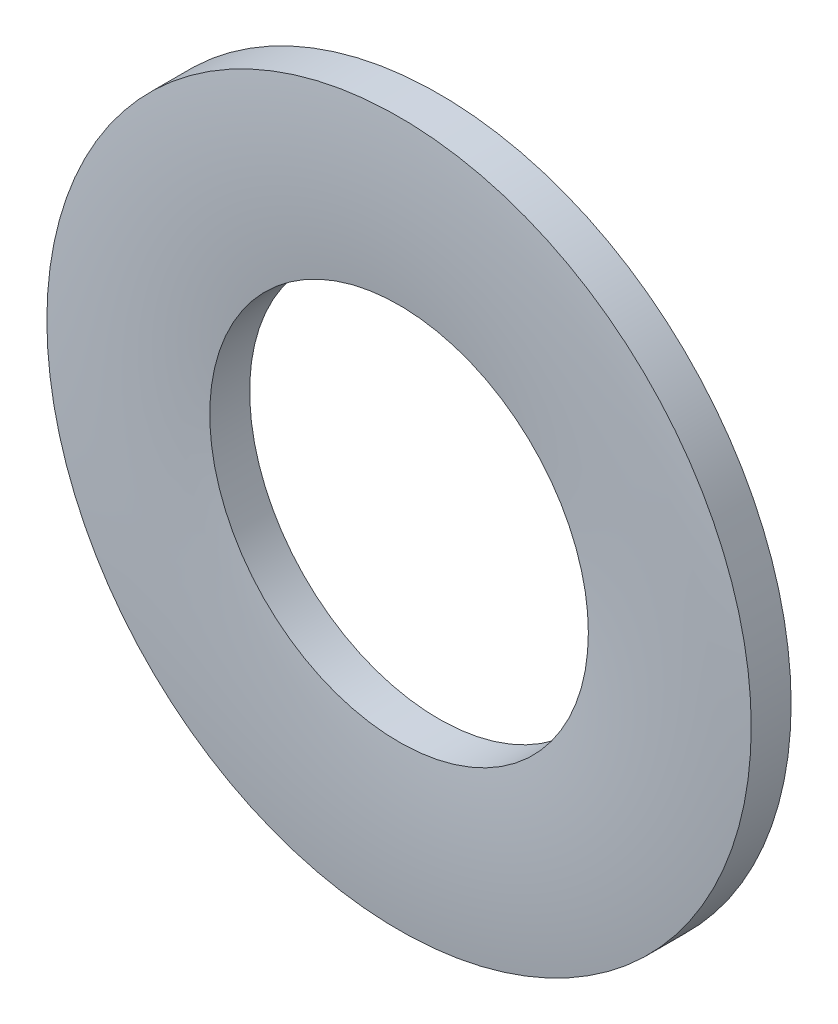
ISO-10303-21;
HEADER;
FILE_DESCRIPTION(('STEP AP214'),'2;1');
FILE_NAME('part.step','',(''),(''),'','','');
FILE_SCHEMA(('AUTOMOTIVE_DESIGN { 1 0 10303 214 1 1 1 1 }'));
ENDSEC;
DATA;
#1=APPLICATION_CONTEXT('core data for automotive mechanical design processes');
#2=APPLICATION_PROTOCOL_DEFINITION('international standard','automotive_design',2000,#1);
#3=PRODUCT_CONTEXT('',#1,'mechanical');
#4=PRODUCT('Part','Part','',(#3));
#5=PRODUCT_RELATED_PRODUCT_CATEGORY('part','',(#4));
#6=PRODUCT_DEFINITION_FORMATION('','',#4);
#7=PRODUCT_DEFINITION_CONTEXT('part definition',#1,'design');
#8=PRODUCT_DEFINITION('design','',#6,#7);
#9=PRODUCT_DEFINITION_SHAPE('','',#8);
#10=(LENGTH_UNIT() NAMED_UNIT(*) SI_UNIT(.MILLI.,.METRE.));
#11=(NAMED_UNIT(*) PLANE_ANGLE_UNIT() SI_UNIT($,.RADIAN.));
#12=(NAMED_UNIT(*) SI_UNIT($,.STERADIAN.) SOLID_ANGLE_UNIT());
#13=UNCERTAINTY_MEASURE_WITH_UNIT(LENGTH_MEASURE(1.E-05),#10,'distance_accuracy_value','');
#14=(GEOMETRIC_REPRESENTATION_CONTEXT(3) GLOBAL_UNCERTAINTY_ASSIGNED_CONTEXT((#13)) GLOBAL_UNIT_ASSIGNED_CONTEXT((#10,
#11,#12)) REPRESENTATION_CONTEXT('',''));
#15=CARTESIAN_POINT('',(0.,0.,0.));
#16=DIRECTION('',(0.,0.,1.));
#17=DIRECTION('',(1.,0.,0.));
#18=AXIS2_PLACEMENT_3D('',#15,#16,#17);
#19=CARTESIAN_POINT('',(0.,2.15,-0.25));
#20=DIRECTION('',(0.,0.,1.));
#21=DIRECTION('',(1.,0.,0.));
#22=AXIS2_PLACEMENT_3D('',#19,#20,#21);
#23=PLANE('',#22);
#24=CARTESIAN_POINT('',(0.,0.,-0.25));
#25=DIRECTION('',(0.,0.,1.));
#26=DIRECTION('',(1.,0.,0.));
#27=AXIS2_PLACEMENT_3D('',#24,#25,#26);
#28=CIRCLE('',#27,4.);
#29=CARTESIAN_POINT('',(4.,0.,-0.25));
#30=VERTEX_POINT('',#29);
#31=EDGE_CURVE('E44',#30,#30,#28,.T.);
#32=ORIENTED_EDGE('',*,*,#31,.F.);
#33=EDGE_LOOP('',(#32));
#34=FACE_BOUND('',#33,.T.);
#35=CARTESIAN_POINT('',(0.,0.,-0.25));
#36=DIRECTION('',(0.,0.,1.));
#37=DIRECTION('',(1.,0.,0.));
#38=AXIS2_PLACEMENT_3D('',#35,#36,#37);
#39=CIRCLE('',#38,2.15);
#40=CARTESIAN_POINT('',(2.15,0.,-0.25));
#41=VERTEX_POINT('',#40);
#42=EDGE_CURVE('E10',#41,#41,#39,.T.);
#43=ORIENTED_EDGE('',*,*,#42,.T.);
#44=EDGE_LOOP('',(#43));
#45=FACE_BOUND('',#44,.T.);
#46=ADVANCED_FACE('F30',(#34,#45),#23,.F.);
#47=CARTESIAN_POINT('',(0.,0.,0.25));
#48=DIRECTION('',(0.,0.,1.));
#49=DIRECTION('',(1.,0.,0.));
#50=AXIS2_PLACEMENT_3D('',#47,#48,#49);
#51=CYLINDRICAL_SURFACE('',#50,2.15);
#52=ORIENTED_EDGE('',*,*,#42,.F.);
#53=EDGE_LOOP('',(#52));
#54=FACE_BOUND('',#53,.T.);
#55=CARTESIAN_POINT('',(0.,0.,0.203149999999999));
#56=DIRECTION('',(0.,0.,1.));
#57=DIRECTION('',(1.,0.,0.));
#58=AXIS2_PLACEMENT_3D('',#55,#56,#57);
#59=CIRCLE('',#58,2.15);
#60=CARTESIAN_POINT('',(2.15,0.,0.203149999999999));
#61=VERTEX_POINT('',#60);
#62=EDGE_CURVE('E36',#61,#61,#59,.T.);
#63=ORIENTED_EDGE('',*,*,#62,.T.);
#64=EDGE_LOOP('',(#63));
#65=FACE_BOUND('',#64,.T.);
#66=ADVANCED_FACE('F53',(#54,#65),#51,.F.);
#67=CARTESIAN_POINT('',(0.,0.,-8.90496181963717));
#68=DIRECTION('',(0.,0.,1.));
#69=DIRECTION('',(1.,0.,0.));
#70=AXIS2_PLACEMENT_3D('',#67,#68,#69);
#71=DEGENERATE_TOROIDAL_SURFACE('',#70,3.075,9.15496181963717,.T.);
#72=ORIENTED_EDGE('',*,*,#62,.F.);
#73=EDGE_LOOP('',(#72));
#74=FACE_BOUND('',#73,.T.);
#75=CARTESIAN_POINT('',(0.,0.,0.20315));
#76=DIRECTION('',(0.,0.,1.));
#77=DIRECTION('',(1.,0.,0.));
#78=AXIS2_PLACEMENT_3D('',#75,#76,#77);
#79=CIRCLE('',#78,4.);
#80=CARTESIAN_POINT('',(4.,0.,0.20315));
#81=VERTEX_POINT('',#80);
#82=EDGE_CURVE('E40',#81,#81,#79,.T.);
#83=ORIENTED_EDGE('',*,*,#82,.T.);
#84=EDGE_LOOP('',(#83));
#85=FACE_BOUND('',#84,.T.);
#86=ADVANCED_FACE('F57',(#74,#85),#71,.T.);
#87=CARTESIAN_POINT('',(0.,0.,0.25));
#88=DIRECTION('',(0.,0.,1.));
#89=DIRECTION('',(1.,0.,0.));
#90=AXIS2_PLACEMENT_3D('',#87,#88,#89);
#91=CYLINDRICAL_SURFACE('',#90,4.);
#92=ORIENTED_EDGE('',*,*,#82,.F.);
#93=EDGE_LOOP('',(#92));
#94=FACE_BOUND('',#93,.T.);
#95=ORIENTED_EDGE('',*,*,#31,.T.);
#96=EDGE_LOOP('',(#95));
#97=FACE_BOUND('',#96,.T.);
#98=ADVANCED_FACE('F50',(#94,#97),#91,.T.);
#99=CLOSED_SHELL('',(#46,#66,#86,#98));
#100=MANIFOLD_SOLID_BREP('B2',#99);
#101=ADVANCED_BREP_SHAPE_REPRESENTATION('',(#18,#100),#14);
#102=SHAPE_DEFINITION_REPRESENTATION(#9,#101);
ENDSEC;
END-ISO-10303-21;
